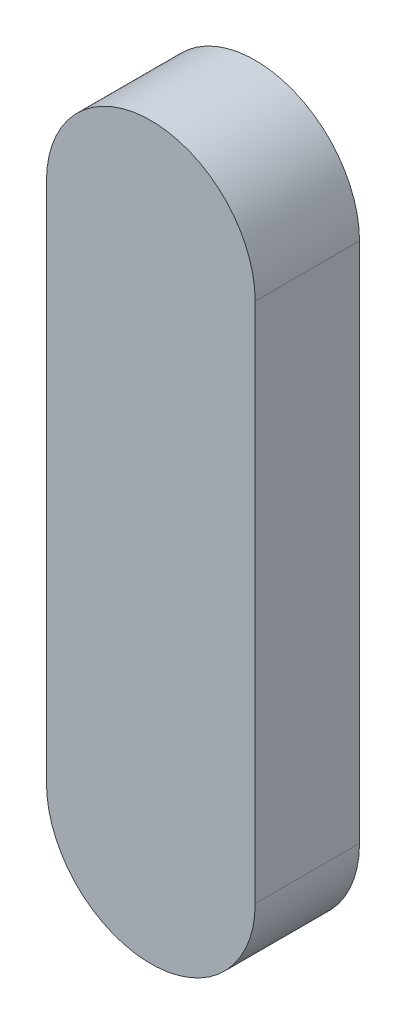
ISO-10303-21;
HEADER;
FILE_DESCRIPTION(('STEP AP214'),'2;1');
FILE_NAME('part.step','',(''),(''),'','','');
FILE_SCHEMA(('AUTOMOTIVE_DESIGN { 1 0 10303 214 1 1 1 1 }'));
ENDSEC;
DATA;
#1=APPLICATION_CONTEXT('core data for automotive mechanical design processes');
#2=APPLICATION_PROTOCOL_DEFINITION('international standard','automotive_design',2000,#1);
#3=PRODUCT_CONTEXT('',#1,'mechanical');
#4=PRODUCT('Part','Part','',(#3));
#5=PRODUCT_RELATED_PRODUCT_CATEGORY('part','',(#4));
#6=PRODUCT_DEFINITION_FORMATION('','',#4);
#7=PRODUCT_DEFINITION_CONTEXT('part definition',#1,'design');
#8=PRODUCT_DEFINITION('design','',#6,#7);
#9=PRODUCT_DEFINITION_SHAPE('','',#8);
#10=(LENGTH_UNIT() NAMED_UNIT(*) SI_UNIT(.MILLI.,.METRE.));
#11=(NAMED_UNIT(*) PLANE_ANGLE_UNIT() SI_UNIT($,.RADIAN.));
#12=(NAMED_UNIT(*) SI_UNIT($,.STERADIAN.) SOLID_ANGLE_UNIT());
#13=UNCERTAINTY_MEASURE_WITH_UNIT(LENGTH_MEASURE(1.E-05),#10,'distance_accuracy_value','');
#14=(GEOMETRIC_REPRESENTATION_CONTEXT(3) GLOBAL_UNCERTAINTY_ASSIGNED_CONTEXT((#13)) GLOBAL_UNIT_ASSIGNED_CONTEXT((#10,
#11,#12)) REPRESENTATION_CONTEXT('',''));
#15=CARTESIAN_POINT('',(0.,0.,0.));
#16=DIRECTION('',(0.,0.,1.));
#17=DIRECTION('',(1.,0.,0.));
#18=AXIS2_PLACEMENT_3D('',#15,#16,#17);
#19=CARTESIAN_POINT('',(0.,0.,5.));
#20=DIRECTION('',(0.,0.,-1.));
#21=DIRECTION('',(-1.,0.,0.));
#22=AXIS2_PLACEMENT_3D('',#19,#20,#21);
#23=CYLINDRICAL_SURFACE('',#22,5.);
#24=CARTESIAN_POINT('',(0.,0.,0.));
#25=DIRECTION('',(0.,0.,1.));
#26=DIRECTION('',(1.,0.,0.));
#27=AXIS2_PLACEMENT_3D('',#24,#25,#26);
#28=CIRCLE('',#27,5.);
#29=CARTESIAN_POINT('',(5.,0.,0.));
#30=VERTEX_POINT('',#29);
#31=CARTESIAN_POINT('',(-5.,0.,0.));
#32=VERTEX_POINT('',#31);
#33=EDGE_CURVE('E107',#30,#32,#28,.T.);
#34=ORIENTED_EDGE('',*,*,#33,.T.);
#35=DIRECTION('',(0.,0.,-1.));
#36=VECTOR('',#35,1.);
#37=CARTESIAN_POINT('',(-5.,0.,5.));
#38=LINE('',#37,#36);
#39=CARTESIAN_POINT('',(-5.,0.,5.));
#40=VERTEX_POINT('',#39);
#41=EDGE_CURVE('E11',#40,#32,#38,.T.);
#42=ORIENTED_EDGE('',*,*,#41,.F.);
#43=CARTESIAN_POINT('',(0.,0.,5.));
#44=DIRECTION('',(0.,0.,1.));
#45=DIRECTION('',(1.,0.,0.));
#46=AXIS2_PLACEMENT_3D('',#43,#44,#45);
#47=CIRCLE('',#46,5.);
#48=CARTESIAN_POINT('',(5.,0.,5.));
#49=VERTEX_POINT('',#48);
#50=EDGE_CURVE('E91',#49,#40,#47,.T.);
#51=ORIENTED_EDGE('',*,*,#50,.F.);
#52=DIRECTION('',(0.,0.,-1.));
#53=VECTOR('',#52,1.);
#54=CARTESIAN_POINT('',(5.,0.,5.));
#55=LINE('',#54,#53);
#56=EDGE_CURVE('E103',#49,#30,#55,.T.);
#57=ORIENTED_EDGE('',*,*,#56,.T.);
#58=EDGE_LOOP('',(#34,#42,#51,#57));
#59=FACE_BOUND('',#58,.T.);
#60=ADVANCED_FACE('F39',(#59),#23,.T.);
#61=CARTESIAN_POINT('',(-5.,0.,5.));
#62=DIRECTION('',(1.,0.,0.));
#63=DIRECTION('',(0.,1.,0.));
#64=AXIS2_PLACEMENT_3D('',#61,#62,#63);
#65=PLANE('',#64);
#66=DIRECTION('',(0.,-1.,0.));
#67=VECTOR('',#66,1.);
#68=CARTESIAN_POINT('',(-5.,0.,0.));
#69=LINE('',#68,#67);
#70=CARTESIAN_POINT('',(-5.,-25.,0.));
#71=VERTEX_POINT('',#70);
#72=EDGE_CURVE('E96',#32,#71,#69,.T.);
#73=ORIENTED_EDGE('',*,*,#72,.T.);
#74=DIRECTION('',(0.,0.,-1.));
#75=VECTOR('',#74,1.);
#76=CARTESIAN_POINT('',(-5.,-25.,5.));
#77=LINE('',#76,#75);
#78=CARTESIAN_POINT('',(-5.,-25.,5.));
#79=VERTEX_POINT('',#78);
#80=EDGE_CURVE('E48',#79,#71,#77,.T.);
#81=ORIENTED_EDGE('',*,*,#80,.F.);
#82=DIRECTION('',(0.,-1.,0.));
#83=VECTOR('',#82,1.);
#84=CARTESIAN_POINT('',(-5.,0.,5.));
#85=LINE('',#84,#83);
#86=EDGE_CURVE('E86',#40,#79,#85,.T.);
#87=ORIENTED_EDGE('',*,*,#86,.F.);
#88=ORIENTED_EDGE('',*,*,#41,.T.);
#89=EDGE_LOOP('',(#73,#81,#87,#88));
#90=FACE_BOUND('',#89,.T.);
#91=ADVANCED_FACE('F95',(#90),#65,.F.);
#92=CARTESIAN_POINT('',(0.,-25.,5.));
#93=DIRECTION('',(0.,0.,-1.));
#94=DIRECTION('',(-1.,0.,0.));
#95=AXIS2_PLACEMENT_3D('',#92,#93,#94);
#96=CYLINDRICAL_SURFACE('',#95,5.);
#97=CARTESIAN_POINT('',(0.,-25.,0.));
#98=DIRECTION('',(0.,0.,1.));
#99=DIRECTION('',(1.,0.,0.));
#100=AXIS2_PLACEMENT_3D('',#97,#98,#99);
#101=CIRCLE('',#100,5.);
#102=CARTESIAN_POINT('',(5.,-25.,0.));
#103=VERTEX_POINT('',#102);
#104=EDGE_CURVE('E73',#71,#103,#101,.T.);
#105=ORIENTED_EDGE('',*,*,#104,.T.);
#106=DIRECTION('',(0.,0.,-1.));
#107=VECTOR('',#106,1.);
#108=CARTESIAN_POINT('',(5.,-25.,5.));
#109=LINE('',#108,#107);
#110=CARTESIAN_POINT('',(5.,-25.,5.));
#111=VERTEX_POINT('',#110);
#112=EDGE_CURVE('E98',#111,#103,#109,.T.);
#113=ORIENTED_EDGE('',*,*,#112,.F.);
#114=CARTESIAN_POINT('',(0.,-25.,5.));
#115=DIRECTION('',(0.,0.,1.));
#116=DIRECTION('',(1.,0.,0.));
#117=AXIS2_PLACEMENT_3D('',#114,#115,#116);
#118=CIRCLE('',#117,5.);
#119=EDGE_CURVE('E89',#79,#111,#118,.T.);
#120=ORIENTED_EDGE('',*,*,#119,.F.);
#121=ORIENTED_EDGE('',*,*,#80,.T.);
#122=EDGE_LOOP('',(#105,#113,#120,#121));
#123=FACE_BOUND('',#122,.T.);
#124=ADVANCED_FACE('F99',(#123),#96,.T.);
#125=CARTESIAN_POINT('',(5.,0.,5.));
#126=DIRECTION('',(-1.,0.,0.));
#127=DIRECTION('',(0.,-1.,0.));
#128=AXIS2_PLACEMENT_3D('',#125,#126,#127);
#129=PLANE('',#128);
#130=DIRECTION('',(0.,1.,0.));
#131=VECTOR('',#130,1.);
#132=CARTESIAN_POINT('',(5.,0.,0.));
#133=LINE('',#132,#131);
#134=EDGE_CURVE('E79',#103,#30,#133,.T.);
#135=ORIENTED_EDGE('',*,*,#134,.T.);
#136=ORIENTED_EDGE('',*,*,#56,.F.);
#137=DIRECTION('',(0.,1.,0.));
#138=VECTOR('',#137,1.);
#139=CARTESIAN_POINT('',(5.,0.,5.));
#140=LINE('',#139,#138);
#141=EDGE_CURVE('E56',#111,#49,#140,.T.);
#142=ORIENTED_EDGE('',*,*,#141,.F.);
#143=ORIENTED_EDGE('',*,*,#112,.T.);
#144=EDGE_LOOP('',(#135,#136,#142,#143));
#145=FACE_BOUND('',#144,.T.);
#146=ADVANCED_FACE('F120',(#145),#129,.F.);
#147=CARTESIAN_POINT('',(0.,0.,5.));
#148=DIRECTION('',(0.,0.,1.));
#149=DIRECTION('',(1.,0.,0.));
#150=AXIS2_PLACEMENT_3D('',#147,#148,#149);
#151=PLANE('',#150);
#152=ORIENTED_EDGE('',*,*,#50,.T.);
#153=ORIENTED_EDGE('',*,*,#86,.T.);
#154=ORIENTED_EDGE('',*,*,#119,.T.);
#155=ORIENTED_EDGE('',*,*,#141,.T.);
#156=EDGE_LOOP('',(#152,#153,#154,#155));
#157=FACE_BOUND('',#156,.T.);
#158=ADVANCED_FACE('F87',(#157),#151,.T.);
#159=CARTESIAN_POINT('',(0.,0.,0.));
#160=DIRECTION('',(0.,0.,1.));
#161=DIRECTION('',(1.,0.,0.));
#162=AXIS2_PLACEMENT_3D('',#159,#160,#161);
#163=PLANE('',#162);
#164=ORIENTED_EDGE('',*,*,#33,.F.);
#165=ORIENTED_EDGE('',*,*,#134,.F.);
#166=ORIENTED_EDGE('',*,*,#104,.F.);
#167=ORIENTED_EDGE('',*,*,#72,.F.);
#168=EDGE_LOOP('',(#164,#165,#166,#167));
#169=FACE_BOUND('',#168,.T.);
#170=ADVANCED_FACE('F123',(#169),#163,.F.);
#171=CLOSED_SHELL('',(#60,#91,#124,#146,#158,#170));
#172=MANIFOLD_SOLID_BREP('B2',#171);
#173=ADVANCED_BREP_SHAPE_REPRESENTATION('',(#18,#172),#14);
#174=SHAPE_DEFINITION_REPRESENTATION(#9,#173);
ENDSEC;
END-ISO-10303-21;
